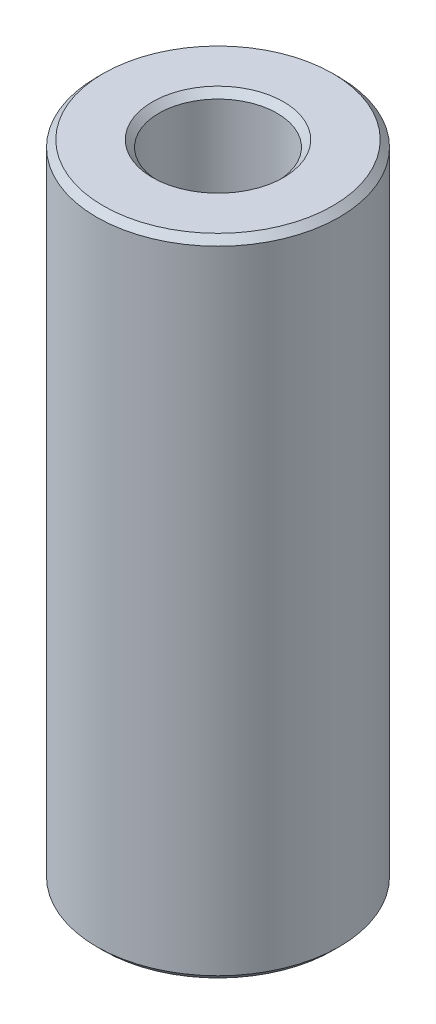
ISO-10303-21;
HEADER;
FILE_DESCRIPTION(('STEP AP214'),'2;1');
FILE_NAME('part.step','',(''),(''),'','','');
FILE_SCHEMA(('AUTOMOTIVE_DESIGN { 1 0 10303 214 1 1 1 1 }'));
ENDSEC;
DATA;
#1=APPLICATION_CONTEXT('core data for automotive mechanical design processes');
#2=APPLICATION_PROTOCOL_DEFINITION('international standard','automotive_design',2000,#1);
#3=PRODUCT_CONTEXT('',#1,'mechanical');
#4=PRODUCT('Part','Part','',(#3));
#5=PRODUCT_RELATED_PRODUCT_CATEGORY('part','',(#4));
#6=PRODUCT_DEFINITION_FORMATION('','',#4);
#7=PRODUCT_DEFINITION_CONTEXT('part definition',#1,'design');
#8=PRODUCT_DEFINITION('design','',#6,#7);
#9=PRODUCT_DEFINITION_SHAPE('','',#8);
#10=(LENGTH_UNIT() NAMED_UNIT(*) SI_UNIT(.MILLI.,.METRE.));
#11=(NAMED_UNIT(*) PLANE_ANGLE_UNIT() SI_UNIT($,.RADIAN.));
#12=(NAMED_UNIT(*) SI_UNIT($,.STERADIAN.) SOLID_ANGLE_UNIT());
#13=UNCERTAINTY_MEASURE_WITH_UNIT(LENGTH_MEASURE(1.E-05),#10,'distance_accuracy_value','');
#14=(GEOMETRIC_REPRESENTATION_CONTEXT(3) GLOBAL_UNCERTAINTY_ASSIGNED_CONTEXT((#13)) GLOBAL_UNIT_ASSIGNED_CONTEXT((#10,
#11,#12)) REPRESENTATION_CONTEXT('',''));
#15=CARTESIAN_POINT('',(0.,0.,0.));
#16=DIRECTION('',(0.,0.,1.));
#17=DIRECTION('',(1.,0.,0.));
#18=AXIS2_PLACEMENT_3D('',#15,#16,#17);
#19=CARTESIAN_POINT('',(0.,265.873656696922,0.));
#20=DIRECTION('',(0.,-1.,0.));
#21=DIRECTION('',(0.,0.,-1.));
#22=AXIS2_PLACEMENT_3D('',#19,#20,#21);
#23=CYLINDRICAL_SURFACE('',#22,50.);
#24=CARTESIAN_POINT('',(0.,2.70543871655843,0.));
#25=DIRECTION('',(0.,1.,0.));
#26=DIRECTION('',(0.,0.,1.));
#27=AXIS2_PLACEMENT_3D('',#24,#25,#26);
#28=CIRCLE('',#27,50.);
#29=CARTESIAN_POINT('',(0.,2.70543871655843,-50.));
#30=VERTEX_POINT('',#29);
#31=EDGE_CURVE('E10',#30,#30,#28,.T.);
#32=CARTESIAN_POINT('',(0.,263.168217980364,0.));
#33=DIRECTION('',(0.,1.,0.));
#34=DIRECTION('',(0.,0.,1.));
#35=AXIS2_PLACEMENT_3D('',#32,#33,#34);
#36=CIRCLE('',#35,50.);
#37=CARTESIAN_POINT('',(0.,263.168217980364,-50.));
#38=VERTEX_POINT('',#37);
#39=EDGE_CURVE('E50',#38,#38,#36,.F.);
#40=CARTESIAN_POINT('',(0.,2.70543871655843,-50.));
#41=CARTESIAN_POINT('',(0.,5.41859266722307,-50.));
#42=CARTESIAN_POINT('',(0.,8.13174661788772,-50.));
#43=CARTESIAN_POINT('',(0.,13.558054519217,-50.));
#44=CARTESIAN_POINT('',(0.,16.2712084698816,-50.));
#45=CARTESIAN_POINT('',(0.,21.6975163712109,-50.));
#46=CARTESIAN_POINT('',(0.,24.4106703218755,-50.));
#47=CARTESIAN_POINT('',(0.,29.8369782232048,-50.));
#48=CARTESIAN_POINT('',(0.,32.5501321738694,-50.));
#49=CARTESIAN_POINT('',(0.,37.9764400751987,-50.));
#50=CARTESIAN_POINT('',(0.,40.6895940258634,-50.));
#51=CARTESIAN_POINT('',(0.,46.1159019271926,-50.));
#52=CARTESIAN_POINT('',(0.,48.8290558778573,-50.));
#53=CARTESIAN_POINT('',(0.,54.2553637791865,-50.));
#54=CARTESIAN_POINT('',(0.,56.9685177298512,-50.));
#55=CARTESIAN_POINT('',(0.,62.3948256311805,-50.));
#56=CARTESIAN_POINT('',(0.,65.1079795818451,-50.));
#57=CARTESIAN_POINT('',(0.,70.5342874831744,-50.));
#58=CARTESIAN_POINT('',(0.,73.247441433839,-50.));
#59=CARTESIAN_POINT('',(0.,78.6737493351683,-50.));
#60=CARTESIAN_POINT('',(0.,81.3869032858329,-50.));
#61=CARTESIAN_POINT('',(0.,86.8132111871622,-50.));
#62=CARTESIAN_POINT('',(0.,89.5263651378269,-50.));
#63=CARTESIAN_POINT('',(0.,94.9526730391562,-50.));
#64=CARTESIAN_POINT('',(0.,97.6658269898208,-50.));
#65=CARTESIAN_POINT('',(0.,103.09213489115,-50.));
#66=CARTESIAN_POINT('',(0.,105.805288841815,-50.));
#67=CARTESIAN_POINT('',(0.,111.231596743144,-50.));
#68=CARTESIAN_POINT('',(0.,113.944750693809,-50.));
#69=CARTESIAN_POINT('',(0.,119.371058595138,-50.));
#70=CARTESIAN_POINT('',(0.,122.084212545803,-50.));
#71=CARTESIAN_POINT('',(0.,127.510520447132,-50.));
#72=CARTESIAN_POINT('',(0.,130.223674397796,-50.));
#73=CARTESIAN_POINT('',(0.,135.649982299126,-50.));
#74=CARTESIAN_POINT('',(0.,138.36313624979,-50.));
#75=CARTESIAN_POINT('',(0.,143.78944415112,-50.));
#76=CARTESIAN_POINT('',(0.,146.502598101784,-50.));
#77=CARTESIAN_POINT('',(0.,151.928906003114,-50.));
#78=CARTESIAN_POINT('',(0.,154.642059953778,-50.));
#79=CARTESIAN_POINT('',(0.,160.068367855108,-50.));
#80=CARTESIAN_POINT('',(0.,162.781521805772,-50.));
#81=CARTESIAN_POINT('',(0.,168.207829707101,-50.));
#82=CARTESIAN_POINT('',(0.,170.920983657766,-50.));
#83=CARTESIAN_POINT('',(0.,176.347291559095,-50.));
#84=CARTESIAN_POINT('',(0.,179.06044550976,-50.));
#85=CARTESIAN_POINT('',(0.,184.486753411089,-50.));
#86=CARTESIAN_POINT('',(0.,187.199907361754,-50.));
#87=CARTESIAN_POINT('',(0.,192.626215263083,-50.));
#88=CARTESIAN_POINT('',(0.,195.339369213748,-50.));
#89=CARTESIAN_POINT('',(0.,200.765677115077,-50.));
#90=CARTESIAN_POINT('',(0.,203.478831065742,-50.));
#91=CARTESIAN_POINT('',(0.,208.905138967071,-50.));
#92=CARTESIAN_POINT('',(0.,211.618292917736,-50.));
#93=CARTESIAN_POINT('',(0.,217.044600819065,-50.));
#94=CARTESIAN_POINT('',(0.,219.75775476973,-50.));
#95=CARTESIAN_POINT('',(0.,225.184062671059,-50.));
#96=CARTESIAN_POINT('',(0.,227.897216621723,-50.));
#97=CARTESIAN_POINT('',(0.,233.323524523053,-50.));
#98=CARTESIAN_POINT('',(0.,236.036678473717,-50.));
#99=CARTESIAN_POINT('',(0.,241.462986375047,-50.));
#100=CARTESIAN_POINT('',(0.,244.176140325711,-50.));
#101=CARTESIAN_POINT('',(0.,249.602448227041,-50.));
#102=CARTESIAN_POINT('',(0.,252.315602177705,-50.));
#103=CARTESIAN_POINT('',(0.,257.741910079034,-50.));
#104=CARTESIAN_POINT('',(0.,260.455064029699,-50.));
#105=CARTESIAN_POINT('',(0.,263.168217980364,-50.));
#106=B_SPLINE_CURVE_WITH_KNOTS('',3,(#40,#41,#42,#43,#44,#45,#46,#47,#48,#49,#50,#51,#52,#53,
#54,#55,#56,#57,#58,#59,#60,#61,#62,#63,#64,#65,#66,#67,#68,#69,#70,#71,#72,#73,#74,#75,#76,#77,
#78,#79,#80,#81,#82,#83,#84,#85,#86,#87,#88,#89,#90,#91,#92,#93,#94,#95,#96,#97,#98,#99,#100,
#101,#102,#103,#104,#105),.UNSPECIFIED.,.F.,.F.,(4,2,2,2,2,2,2,2,2,2,2,2,2,2,2,2,2,2,2,2,2,2,2,
2,2,2,2,2,2,2,2,2,4),(0.,8.13946185199393,16.2789237039878,24.4183855559817,32.5578474079757,
40.6973092599696,48.8367711119635,56.9762329639574,65.1156948159513,73.2551566679452,
81.3946185199391,89.5340803719331,97.673542223927,105.813004075921,113.952465927915,
122.091927779909,130.231389631903,138.370851483897,146.51031333589,154.649775187884,
162.789237039878,170.928698891872,179.068160743866,187.20762259586,195.347084447854,
203.486546299848,211.626008151842,219.765470003836,227.90493185583,236.044393707824,
244.183855559818,252.323317411811,260.462779263805),.UNSPECIFIED.);
#107=EDGE_CURVE('BSEAM39',#30,#38,#106,.T.);
#108=ORIENTED_EDGE('',*,*,#31,.T.);
#109=ORIENTED_EDGE('',*,*,#39,.T.);
#110=ORIENTED_EDGE('',*,*,#107,.T.);
#111=ORIENTED_EDGE('',*,*,#107,.F.);
#112=EDGE_LOOP('',(#108,#110,#109,#111));
#113=FACE_BOUND('',#112,.T.);
#114=ADVANCED_FACE('F39',(#113),#23,.T.);
#115=CARTESIAN_POINT('',(0.,265.873656696922,0.));
#116=DIRECTION('',(0.,1.,0.));
#117=DIRECTION('',(0.,0.,1.));
#118=AXIS2_PLACEMENT_3D('',#115,#116,#117);
#119=PLANE('',#118);
#120=CARTESIAN_POINT('',(0.,265.873656696922,0.));
#121=DIRECTION('',(0.,1.,0.));
#122=DIRECTION('',(0.,0.,1.));
#123=AXIS2_PLACEMENT_3D('',#120,#121,#122);
#124=CIRCLE('',#123,27.0429298729229);
#125=CARTESIAN_POINT('',(0.,265.873656696922,27.0429298729229));
#126=VERTEX_POINT('',#125);
#127=EDGE_CURVE('E58',#126,#126,#124,.F.);
#128=ORIENTED_EDGE('',*,*,#127,.T.);
#129=EDGE_LOOP('',(#128));
#130=FACE_BOUND('',#129,.T.);
#131=CARTESIAN_POINT('',(0.,265.873656696922,0.));
#132=DIRECTION('',(0.,1.,0.));
#133=DIRECTION('',(0.,0.,1.));
#134=AXIS2_PLACEMENT_3D('',#131,#132,#133);
#135=CIRCLE('',#134,47.2945612834419);
#136=CARTESIAN_POINT('',(0.,265.873656696922,47.2945612834419));
#137=VERTEX_POINT('',#136);
#138=EDGE_CURVE('E61',#137,#137,#135,.T.);
#139=ORIENTED_EDGE('',*,*,#138,.T.);
#140=EDGE_LOOP('',(#139));
#141=FACE_BOUND('',#140,.T.);
#142=ADVANCED_FACE('F88',(#130,#141),#119,.T.);
#143=CARTESIAN_POINT('',(0.,0.,0.));
#144=DIRECTION('',(0.,1.,0.));
#145=DIRECTION('',(0.,0.,1.));
#146=AXIS2_PLACEMENT_3D('',#143,#144,#145);
#147=PLANE('',#146);
#148=CARTESIAN_POINT('',(0.,0.,0.));
#149=DIRECTION('',(0.,1.,0.));
#150=DIRECTION('',(0.,0.,1.));
#151=AXIS2_PLACEMENT_3D('',#148,#149,#150);
#152=CIRCLE('',#151,27.0429298729226);
#153=CARTESIAN_POINT('',(0.,0.,27.0429298729226));
#154=VERTEX_POINT('',#153);
#155=EDGE_CURVE('E51',#154,#154,#152,.T.);
#156=ORIENTED_EDGE('',*,*,#155,.T.);
#157=EDGE_LOOP('',(#156));
#158=FACE_BOUND('',#157,.T.);
#159=CARTESIAN_POINT('',(0.,0.,0.));
#160=DIRECTION('',(0.,1.,0.));
#161=DIRECTION('',(0.,0.,1.));
#162=AXIS2_PLACEMENT_3D('',#159,#160,#161);
#163=CIRCLE('',#162,47.2945612834416);
#164=CARTESIAN_POINT('',(0.,0.,47.2945612834416));
#165=VERTEX_POINT('',#164);
#166=EDGE_CURVE('E54',#165,#165,#163,.F.);
#167=ORIENTED_EDGE('',*,*,#166,.T.);
#168=EDGE_LOOP('',(#167));
#169=FACE_BOUND('',#168,.T.);
#170=ADVANCED_FACE('F83',(#158,#169),#147,.F.);
#171=CARTESIAN_POINT('',(0.,265.873656696922,0.));
#172=DIRECTION('',(0.,-1.,0.));
#173=DIRECTION('',(0.,0.,-1.));
#174=AXIS2_PLACEMENT_3D('',#171,#172,#173);
#175=CYLINDRICAL_SURFACE('',#174,24.3374911563645);
#176=CARTESIAN_POINT('',(0.,263.168217980364,0.));
#177=DIRECTION('',(0.,1.,0.));
#178=DIRECTION('',(0.,0.,1.));
#179=AXIS2_PLACEMENT_3D('',#176,#177,#178);
#180=CIRCLE('',#179,24.3374911563645);
#181=CARTESIAN_POINT('',(0.,263.168217980363,-24.3374911563645));
#182=VERTEX_POINT('',#181);
#183=EDGE_CURVE('E67',#182,#182,#180,.T.);
#184=CARTESIAN_POINT('',(0.,2.7054387165581,0.));
#185=DIRECTION('',(0.,1.,0.));
#186=DIRECTION('',(0.,0.,1.));
#187=AXIS2_PLACEMENT_3D('',#184,#185,#186);
#188=CIRCLE('',#187,24.3374911563645);
#189=CARTESIAN_POINT('',(0.,2.7054387165581,-24.3374911563645));
#190=VERTEX_POINT('',#189);
#191=EDGE_CURVE('E69',#190,#190,#188,.F.);
#192=CARTESIAN_POINT('',(0.,263.168217980363,-24.3374911563645));
#193=CARTESIAN_POINT('',(0.,260.455064029699,-24.3374911563645));
#194=CARTESIAN_POINT('',(0.,257.741910079034,-24.3374911563645));
#195=CARTESIAN_POINT('',(0.,252.315602177705,-24.3374911563645));
#196=CARTESIAN_POINT('',(0.,249.60244822704,-24.3374911563645));
#197=CARTESIAN_POINT('',(0.,244.176140325711,-24.3374911563645));
#198=CARTESIAN_POINT('',(0.,241.462986375046,-24.3374911563645));
#199=CARTESIAN_POINT('',(0.,236.036678473717,-24.3374911563645));
#200=CARTESIAN_POINT('',(0.,233.323524523052,-24.3374911563645));
#201=CARTESIAN_POINT('',(0.,227.897216621723,-24.3374911563645));
#202=CARTESIAN_POINT('',(0.,225.184062671059,-24.3374911563645));
#203=CARTESIAN_POINT('',(0.,219.757754769729,-24.3374911563645));
#204=CARTESIAN_POINT('',(0.,217.044600819065,-24.3374911563645));
#205=CARTESIAN_POINT('',(0.,211.618292917735,-24.3374911563645));
#206=CARTESIAN_POINT('',(0.,208.905138967071,-24.3374911563645));
#207=CARTESIAN_POINT('',(0.,203.478831065741,-24.3374911563645));
#208=CARTESIAN_POINT('',(0.,200.765677115077,-24.3374911563645));
#209=CARTESIAN_POINT('',(0.,195.339369213747,-24.3374911563645));
#210=CARTESIAN_POINT('',(0.,192.626215263083,-24.3374911563645));
#211=CARTESIAN_POINT('',(0.,187.199907361754,-24.3374911563645));
#212=CARTESIAN_POINT('',(0.,184.486753411089,-24.3374911563645));
#213=CARTESIAN_POINT('',(0.,179.06044550976,-24.3374911563645));
#214=CARTESIAN_POINT('',(0.,176.347291559095,-24.3374911563645));
#215=CARTESIAN_POINT('',(0.,170.920983657766,-24.3374911563645));
#216=CARTESIAN_POINT('',(0.,168.207829707101,-24.3374911563645));
#217=CARTESIAN_POINT('',(0.,162.781521805772,-24.3374911563645));
#218=CARTESIAN_POINT('',(0.,160.068367855107,-24.3374911563645));
#219=CARTESIAN_POINT('',(0.,154.642059953778,-24.3374911563645));
#220=CARTESIAN_POINT('',(0.,151.928906003113,-24.3374911563645));
#221=CARTESIAN_POINT('',(0.,146.502598101784,-24.3374911563645));
#222=CARTESIAN_POINT('',(0.,143.789444151119,-24.3374911563645));
#223=CARTESIAN_POINT('',(0.,138.36313624979,-24.3374911563645));
#224=CARTESIAN_POINT('',(0.,135.649982299125,-24.3374911563645));
#225=CARTESIAN_POINT('',(0.,130.223674397796,-24.3374911563645));
#226=CARTESIAN_POINT('',(0.,127.510520447132,-24.3374911563645));
#227=CARTESIAN_POINT('',(0.,122.084212545802,-24.3374911563645));
#228=CARTESIAN_POINT('',(0.,119.371058595138,-24.3374911563645));
#229=CARTESIAN_POINT('',(0.,113.944750693808,-24.3374911563645));
#230=CARTESIAN_POINT('',(0.,111.231596743144,-24.3374911563645));
#231=CARTESIAN_POINT('',(0.,105.805288841814,-24.3374911563645));
#232=CARTESIAN_POINT('',(0.,103.09213489115,-24.3374911563645));
#233=CARTESIAN_POINT('',(0.,97.6658269898205,-24.3374911563645));
#234=CARTESIAN_POINT('',(0.,94.9526730391558,-24.3374911563645));
#235=CARTESIAN_POINT('',(0.,89.5263651378266,-24.3374911563645));
#236=CARTESIAN_POINT('',(0.,86.8132111871619,-24.3374911563645));
#237=CARTESIAN_POINT('',(0.,81.3869032858326,-24.3374911563645));
#238=CARTESIAN_POINT('',(0.,78.673749335168,-24.3374911563645));
#239=CARTESIAN_POINT('',(0.,73.2474414338387,-24.3374911563645));
#240=CARTESIAN_POINT('',(0.,70.5342874831741,-24.3374911563645));
#241=CARTESIAN_POINT('',(0.,65.1079795818448,-24.3374911563645));
#242=CARTESIAN_POINT('',(0.,62.3948256311802,-24.3374911563645));
#243=CARTESIAN_POINT('',(0.,56.9685177298509,-24.3374911563645));
#244=CARTESIAN_POINT('',(0.,54.2553637791863,-24.3374911563645));
#245=CARTESIAN_POINT('',(0.,48.829055877857,-24.3374911563645));
#246=CARTESIAN_POINT('',(0.,46.1159019271923,-24.3374911563645));
#247=CARTESIAN_POINT('',(0.,40.6895940258631,-24.3374911563645));
#248=CARTESIAN_POINT('',(0.,37.9764400751984,-24.3374911563645));
#249=CARTESIAN_POINT('',(0.,32.5501321738691,-24.3374911563645));
#250=CARTESIAN_POINT('',(0.,29.8369782232045,-24.3374911563645));
#251=CARTESIAN_POINT('',(0.,24.4106703218752,-24.3374911563645));
#252=CARTESIAN_POINT('',(0.,21.6975163712106,-24.3374911563645));
#253=CARTESIAN_POINT('',(0.,16.2712084698813,-24.3374911563645));
#254=CARTESIAN_POINT('',(0.,13.5580545192167,-24.3374911563645));
#255=CARTESIAN_POINT('',(0.,8.13174661788738,-24.3374911563645));
#256=CARTESIAN_POINT('',(0.,5.41859266722274,-24.3374911563645));
#257=CARTESIAN_POINT('',(0.,2.7054387165581,-24.3374911563645));
#258=B_SPLINE_CURVE_WITH_KNOTS('',3,(#192,#193,#194,#195,#196,#197,#198,#199,#200,#201,#202,
#203,#204,#205,#206,#207,#208,#209,#210,#211,#212,#213,#214,#215,#216,#217,#218,#219,#220,#221,
#222,#223,#224,#225,#226,#227,#228,#229,#230,#231,#232,#233,#234,#235,#236,#237,#238,#239,#240,
#241,#242,#243,#244,#245,#246,#247,#248,#249,#250,#251,#252,#253,#254,#255,#256,#257),
.UNSPECIFIED.,.F.,.F.,(4,2,2,2,2,2,2,2,2,2,2,2,2,2,2,2,2,2,2,2,2,2,2,2,2,2,2,2,2,2,2,2,4),(0.,
8.13946185199388,16.2789237039878,24.4183855559817,32.5578474079756,40.6973092599696,
48.8367711119635,56.9762329639574,65.1156948159513,73.2551566679452,81.3946185199391,
89.5340803719331,97.673542223927,105.813004075921,113.952465927915,122.091927779909,
130.231389631903,138.370851483897,146.51031333589,154.649775187884,162.789237039878,
170.928698891872,179.068160743866,187.20762259586,195.347084447854,203.486546299848,
211.626008151842,219.765470003836,227.90493185583,236.044393707824,244.183855559818,
252.323317411811,260.462779263805),.UNSPECIFIED.);
#259=EDGE_CURVE('BSEAM71',#182,#190,#258,.T.);
#260=ORIENTED_EDGE('',*,*,#183,.T.);
#261=ORIENTED_EDGE('',*,*,#191,.T.);
#262=ORIENTED_EDGE('',*,*,#259,.T.);
#263=ORIENTED_EDGE('',*,*,#259,.F.);
#264=EDGE_LOOP('',(#260,#262,#261,#263));
#265=FACE_BOUND('',#264,.T.);
#266=ADVANCED_FACE('F71',(#265),#175,.F.);
#267=CARTESIAN_POINT('',(0.,263.168217980364,0.));
#268=DIRECTION('',(0.,1.,0.));
#269=DIRECTION('',(0.,0.,1.));
#270=AXIS2_PLACEMENT_3D('',#267,#268,#269);
#271=CONICAL_SURFACE('',#270,24.3374911563645,0.785398163397452);
#272=ORIENTED_EDGE('',*,*,#127,.F.);
#273=EDGE_LOOP('',(#272));
#274=FACE_BOUND('',#273,.T.);
#275=ORIENTED_EDGE('',*,*,#183,.F.);
#276=EDGE_LOOP('',(#275));
#277=FACE_BOUND('',#276,.T.);
#278=ADVANCED_FACE('F77',(#274,#277),#271,.F.);
#279=CARTESIAN_POINT('',(0.,0.,0.));
#280=DIRECTION('',(0.,-1.,0.));
#281=DIRECTION('',(0.,0.,-1.));
#282=AXIS2_PLACEMENT_3D('',#279,#280,#281);
#283=CONICAL_SURFACE('',#282,27.0429298729226,0.785398163397451);
#284=ORIENTED_EDGE('',*,*,#191,.F.);
#285=EDGE_LOOP('',(#284));
#286=FACE_BOUND('',#285,.T.);
#287=ORIENTED_EDGE('',*,*,#155,.F.);
#288=EDGE_LOOP('',(#287));
#289=FACE_BOUND('',#288,.T.);
#290=ADVANCED_FACE('F73',(#286,#289),#283,.F.);
#291=CARTESIAN_POINT('',(0.,2.70543871655843,0.));
#292=DIRECTION('',(0.,1.,0.));
#293=DIRECTION('',(0.,0.,1.));
#294=AXIS2_PLACEMENT_3D('',#291,#292,#293);
#295=CONICAL_SURFACE('',#294,50.,0.785398163397452);
#296=ORIENTED_EDGE('',*,*,#166,.F.);
#297=EDGE_LOOP('',(#296));
#298=FACE_BOUND('',#297,.T.);
#299=ORIENTED_EDGE('',*,*,#31,.F.);
#300=EDGE_LOOP('',(#299));
#301=FACE_BOUND('',#300,.T.);
#302=ADVANCED_FACE('F76',(#298,#301),#295,.T.);
#303=CARTESIAN_POINT('',(0.,265.873656696922,0.));
#304=DIRECTION('',(0.,-1.,0.));
#305=DIRECTION('',(0.,0.,-1.));
#306=AXIS2_PLACEMENT_3D('',#303,#304,#305);
#307=CONICAL_SURFACE('',#306,47.2945612834419,0.785398163397453);
#308=ORIENTED_EDGE('',*,*,#39,.F.);
#309=EDGE_LOOP('',(#308));
#310=FACE_BOUND('',#309,.T.);
#311=ORIENTED_EDGE('',*,*,#138,.F.);
#312=EDGE_LOOP('',(#311));
#313=FACE_BOUND('',#312,.T.);
#314=ADVANCED_FACE('F45',(#310,#313),#307,.T.);
#315=CLOSED_SHELL('',(#114,#142,#170,#266,#278,#290,#302,#314));
#316=MANIFOLD_SOLID_BREP('B2',#315);
#317=ADVANCED_BREP_SHAPE_REPRESENTATION('',(#18,#316),#14);
#318=SHAPE_DEFINITION_REPRESENTATION(#9,#317);
ENDSEC;
END-ISO-10303-21;
